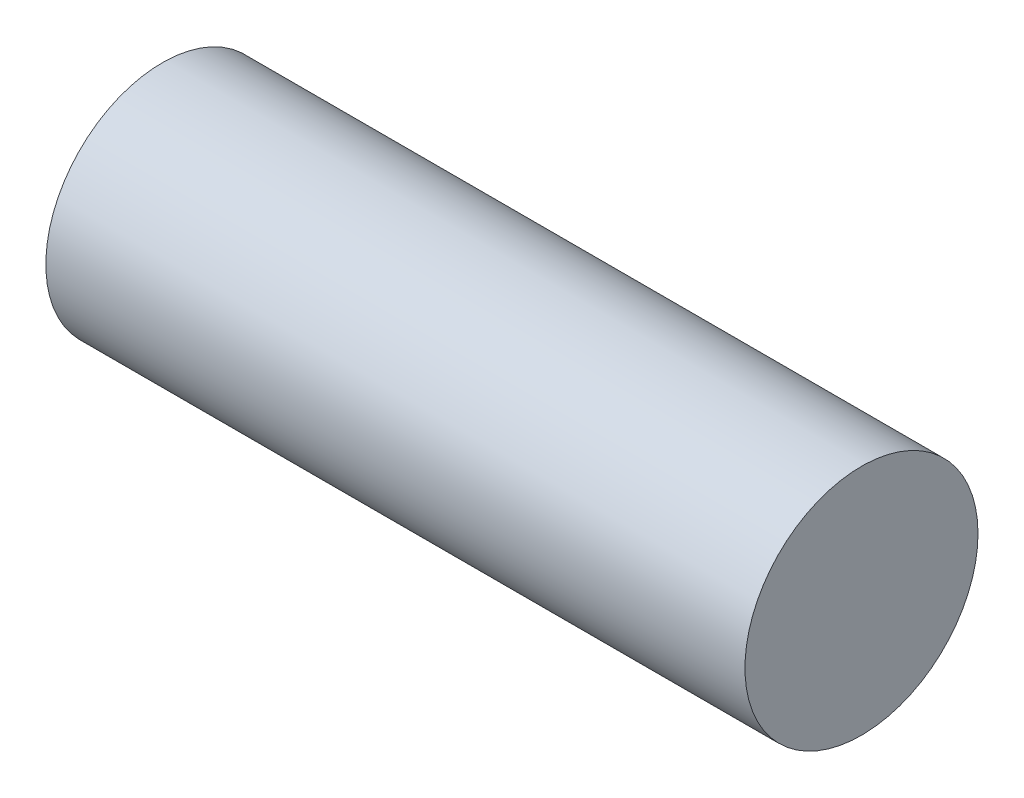
ISO-10303-21;
HEADER;
FILE_DESCRIPTION(('STEP AP214'),'2;1');
FILE_NAME('part.step','',(''),(''),'','','');
FILE_SCHEMA(('AUTOMOTIVE_DESIGN { 1 0 10303 214 1 1 1 1 }'));
ENDSEC;
DATA;
#1=APPLICATION_CONTEXT('core data for automotive mechanical design processes');
#2=APPLICATION_PROTOCOL_DEFINITION('international standard','automotive_design',2000,#1);
#3=PRODUCT_CONTEXT('',#1,'mechanical');
#4=PRODUCT('Part','Part','',(#3));
#5=PRODUCT_RELATED_PRODUCT_CATEGORY('part','',(#4));
#6=PRODUCT_DEFINITION_FORMATION('','',#4);
#7=PRODUCT_DEFINITION_CONTEXT('part definition',#1,'design');
#8=PRODUCT_DEFINITION('design','',#6,#7);
#9=PRODUCT_DEFINITION_SHAPE('','',#8);
#10=(LENGTH_UNIT() NAMED_UNIT(*) SI_UNIT(.MILLI.,.METRE.));
#11=(NAMED_UNIT(*) PLANE_ANGLE_UNIT() SI_UNIT($,.RADIAN.));
#12=(NAMED_UNIT(*) SI_UNIT($,.STERADIAN.) SOLID_ANGLE_UNIT());
#13=UNCERTAINTY_MEASURE_WITH_UNIT(LENGTH_MEASURE(1.E-05),#10,'distance_accuracy_value','');
#14=(GEOMETRIC_REPRESENTATION_CONTEXT(3) GLOBAL_UNCERTAINTY_ASSIGNED_CONTEXT((#13)) GLOBAL_UNIT_ASSIGNED_CONTEXT((#10,
#11,#12)) REPRESENTATION_CONTEXT('',''));
#15=CARTESIAN_POINT('',(0.,0.,0.));
#16=DIRECTION('',(0.,0.,1.));
#17=DIRECTION('',(1.,0.,0.));
#18=AXIS2_PLACEMENT_3D('',#15,#16,#17);
#19=CARTESIAN_POINT('',(90.,0.,0.));
#20=DIRECTION('',(-1.,0.,0.));
#21=DIRECTION('',(0.,0.,1.));
#22=AXIS2_PLACEMENT_3D('',#19,#20,#21);
#23=CYLINDRICAL_SURFACE('',#22,15.);
#24=CARTESIAN_POINT('',(90.,0.,0.));
#25=DIRECTION('',(1.,0.,0.));
#26=DIRECTION('',(0.,0.,-1.));
#27=AXIS2_PLACEMENT_3D('',#24,#25,#26);
#28=CIRCLE('',#27,15.);
#29=CARTESIAN_POINT('',(90.,0.,-15.));
#30=VERTEX_POINT('',#29);
#31=EDGE_CURVE('E10',#30,#30,#28,.T.);
#32=ORIENTED_EDGE('',*,*,#31,.F.);
#33=EDGE_LOOP('',(#32));
#34=FACE_BOUND('',#33,.T.);
#35=CARTESIAN_POINT('',(0.,0.,0.));
#36=DIRECTION('',(1.,0.,0.));
#37=DIRECTION('',(0.,0.,-1.));
#38=AXIS2_PLACEMENT_3D('',#35,#36,#37);
#39=CIRCLE('',#38,15.);
#40=CARTESIAN_POINT('',(0.,0.,-15.));
#41=VERTEX_POINT('',#40);
#42=EDGE_CURVE('E34',#41,#41,#39,.T.);
#43=ORIENTED_EDGE('',*,*,#42,.T.);
#44=EDGE_LOOP('',(#43));
#45=FACE_BOUND('',#44,.T.);
#46=ADVANCED_FACE('F31',(#34,#45),#23,.T.);
#47=CARTESIAN_POINT('',(90.,0.,0.));
#48=DIRECTION('',(1.,0.,0.));
#49=DIRECTION('',(0.,0.,-1.));
#50=AXIS2_PLACEMENT_3D('',#47,#48,#49);
#51=PLANE('',#50);
#52=ORIENTED_EDGE('',*,*,#31,.T.);
#53=EDGE_LOOP('',(#52));
#54=FACE_BOUND('',#53,.T.);
#55=ADVANCED_FACE('F46',(#54),#51,.T.);
#56=CARTESIAN_POINT('',(0.,0.,0.));
#57=DIRECTION('',(1.,0.,0.));
#58=DIRECTION('',(0.,0.,-1.));
#59=AXIS2_PLACEMENT_3D('',#56,#57,#58);
#60=PLANE('',#59);
#61=ORIENTED_EDGE('',*,*,#42,.F.);
#62=EDGE_LOOP('',(#61));
#63=FACE_BOUND('',#62,.T.);
#64=ADVANCED_FACE('F44',(#63),#60,.F.);
#65=CLOSED_SHELL('',(#46,#55,#64));
#66=MANIFOLD_SOLID_BREP('B2',#65);
#67=ADVANCED_BREP_SHAPE_REPRESENTATION('',(#18,#66),#14);
#68=SHAPE_DEFINITION_REPRESENTATION(#9,#67);
ENDSEC;
END-ISO-10303-21;
